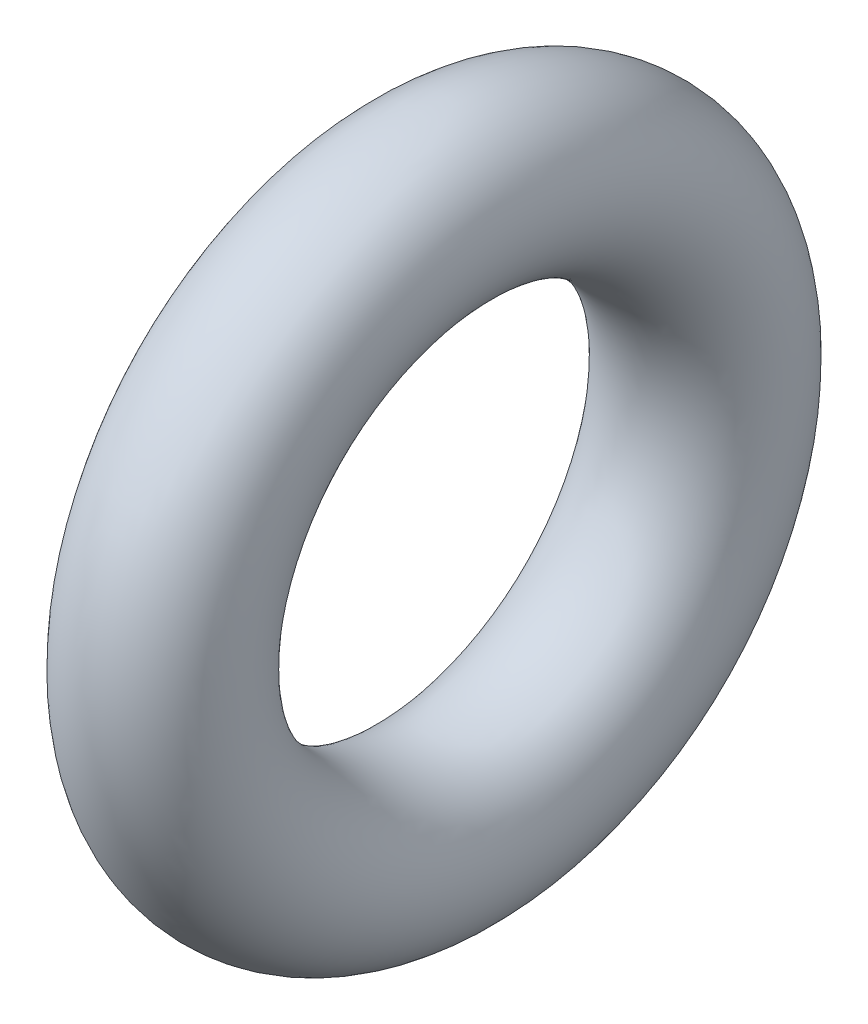
ISO-10303-21;
HEADER;
FILE_DESCRIPTION(('STEP AP214'),'2;1');
FILE_NAME('part.step','',(''),(''),'','','');
FILE_SCHEMA(('AUTOMOTIVE_DESIGN { 1 0 10303 214 1 1 1 1 }'));
ENDSEC;
DATA;
#1=APPLICATION_CONTEXT('core data for automotive mechanical design processes');
#2=APPLICATION_PROTOCOL_DEFINITION('international standard','automotive_design',2000,#1);
#3=PRODUCT_CONTEXT('',#1,'mechanical');
#4=PRODUCT('Part','Part','',(#3));
#5=PRODUCT_RELATED_PRODUCT_CATEGORY('part','',(#4));
#6=PRODUCT_DEFINITION_FORMATION('','',#4);
#7=PRODUCT_DEFINITION_CONTEXT('part definition',#1,'design');
#8=PRODUCT_DEFINITION('design','',#6,#7);
#9=PRODUCT_DEFINITION_SHAPE('','',#8);
#10=(LENGTH_UNIT() NAMED_UNIT(*) SI_UNIT(.MILLI.,.METRE.));
#11=(NAMED_UNIT(*) PLANE_ANGLE_UNIT() SI_UNIT($,.RADIAN.));
#12=(NAMED_UNIT(*) SI_UNIT($,.STERADIAN.) SOLID_ANGLE_UNIT());
#13=UNCERTAINTY_MEASURE_WITH_UNIT(LENGTH_MEASURE(1.E-05),#10,'distance_accuracy_value','');
#14=(GEOMETRIC_REPRESENTATION_CONTEXT(3) GLOBAL_UNCERTAINTY_ASSIGNED_CONTEXT((#13)) GLOBAL_UNIT_ASSIGNED_CONTEXT((#10,
#11,#12)) REPRESENTATION_CONTEXT('',''));
#15=CARTESIAN_POINT('',(0.,0.,0.));
#16=DIRECTION('',(0.,0.,1.));
#17=DIRECTION('',(1.,0.,0.));
#18=AXIS2_PLACEMENT_3D('',#15,#16,#17);
#19=CARTESIAN_POINT('',(0.,0.,0.));
#20=DIRECTION('',(1.,0.,0.));
#21=DIRECTION('',(0.,0.,-1.));
#22=AXIS2_PLACEMENT_3D('',#19,#20,#21);
#23=TOROIDAL_SURFACE('',#22,4.3,1.3);
#24=CARTESIAN_POINT('',(0.,0.,-5.6));
#25=VERTEX_POINT('',#24);
#26=VERTEX_LOOP('',#25);
#27=FACE_BOUND('',#26,.T.);
#28=ADVANCED_FACE('F31',(#27),#23,.T.);
#29=CLOSED_SHELL('',(#28));
#30=MANIFOLD_SOLID_BREP('B2',#29);
#31=ADVANCED_BREP_SHAPE_REPRESENTATION('',(#18,#30),#14);
#32=SHAPE_DEFINITION_REPRESENTATION(#9,#31);
ENDSEC;
END-ISO-10303-21;
